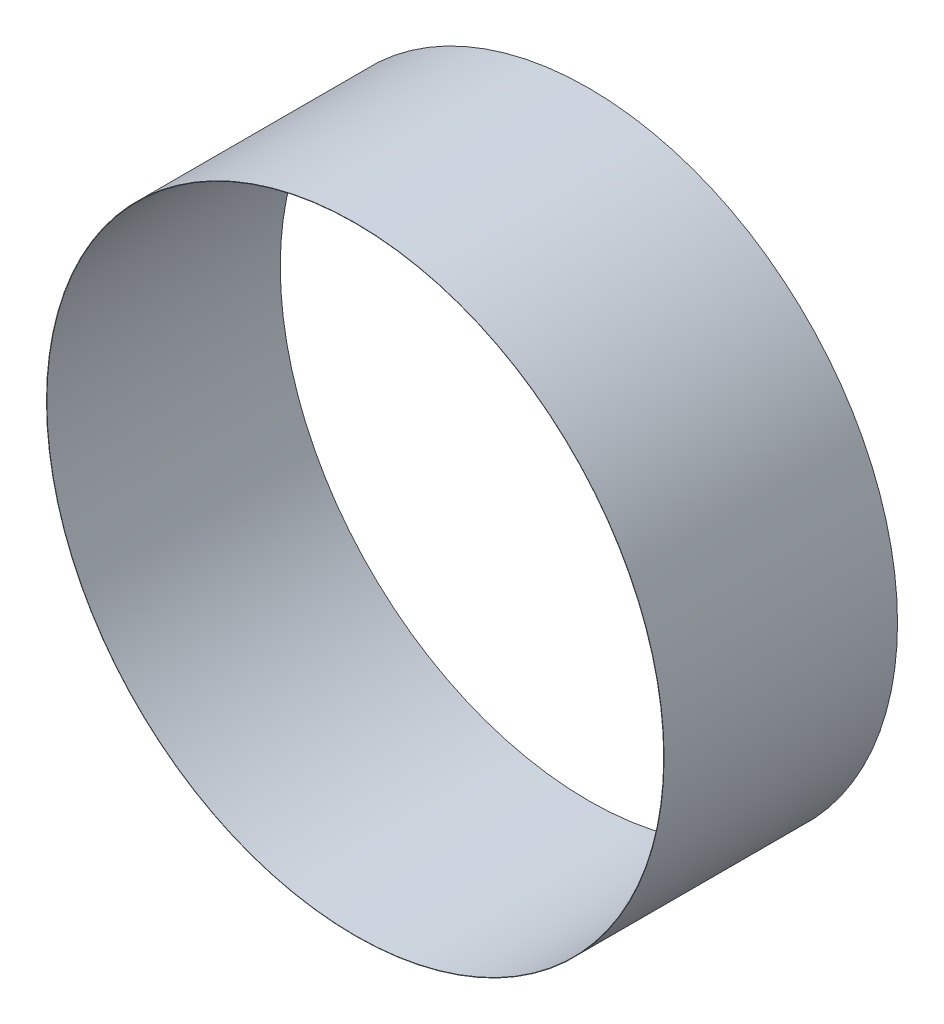
ISO-10303-21;
HEADER;
FILE_DESCRIPTION(('STEP AP214'),'2;1');
FILE_NAME('part.step','',(''),(''),'','','');
FILE_SCHEMA(('AUTOMOTIVE_DESIGN { 1 0 10303 214 1 1 1 1 }'));
ENDSEC;
DATA;
#1=APPLICATION_CONTEXT('core data for automotive mechanical design processes');
#2=APPLICATION_PROTOCOL_DEFINITION('international standard','automotive_design',2000,#1);
#3=PRODUCT_CONTEXT('',#1,'mechanical');
#4=PRODUCT('Part','Part','',(#3));
#5=PRODUCT_RELATED_PRODUCT_CATEGORY('part','',(#4));
#6=PRODUCT_DEFINITION_FORMATION('','',#4);
#7=PRODUCT_DEFINITION_CONTEXT('part definition',#1,'design');
#8=PRODUCT_DEFINITION('design','',#6,#7);
#9=PRODUCT_DEFINITION_SHAPE('','',#8);
#10=(LENGTH_UNIT() NAMED_UNIT(*) SI_UNIT(.MILLI.,.METRE.));
#11=(NAMED_UNIT(*) PLANE_ANGLE_UNIT() SI_UNIT($,.RADIAN.));
#12=(NAMED_UNIT(*) SI_UNIT($,.STERADIAN.) SOLID_ANGLE_UNIT());
#13=UNCERTAINTY_MEASURE_WITH_UNIT(LENGTH_MEASURE(1.E-05),#10,'distance_accuracy_value','');
#14=(GEOMETRIC_REPRESENTATION_CONTEXT(3) GLOBAL_UNCERTAINTY_ASSIGNED_CONTEXT((#13)) GLOBAL_UNIT_ASSIGNED_CONTEXT((#10,
#11,#12)) REPRESENTATION_CONTEXT('',''));
#15=CARTESIAN_POINT('',(0.,0.,0.));
#16=DIRECTION('',(0.,0.,1.));
#17=DIRECTION('',(1.,0.,0.));
#18=AXIS2_PLACEMENT_3D('',#15,#16,#17);
#19=CARTESIAN_POINT('',(0.,0.,70.));
#20=DIRECTION('',(0.,0.,1.));
#21=DIRECTION('',(1.,0.,0.));
#22=AXIS2_PLACEMENT_3D('',#19,#20,#21);
#23=PLANE('',#22);
#24=CARTESIAN_POINT('',(0.,0.,70.));
#25=DIRECTION('',(0.,0.,1.));
#26=DIRECTION('',(1.,0.,0.));
#27=AXIS2_PLACEMENT_3D('',#24,#25,#26);
#28=CIRCLE('',#27,92.6);
#29=CARTESIAN_POINT('',(92.6,0.,70.));
#30=VERTEX_POINT('',#29);
#31=EDGE_CURVE('E10',#30,#30,#28,.T.);
#32=ORIENTED_EDGE('',*,*,#31,.T.);
#33=EDGE_LOOP('',(#32));
#34=FACE_BOUND('',#33,.T.);
#35=CARTESIAN_POINT('',(0.,0.,70.));
#36=DIRECTION('',(0.,0.,1.));
#37=DIRECTION('',(1.,0.,0.));
#38=AXIS2_PLACEMENT_3D('',#35,#36,#37);
#39=CIRCLE('',#38,92.5);
#40=CARTESIAN_POINT('',(92.5,0.,70.));
#41=VERTEX_POINT('',#40);
#42=EDGE_CURVE('E44',#41,#41,#39,.T.);
#43=ORIENTED_EDGE('',*,*,#42,.F.);
#44=EDGE_LOOP('',(#43));
#45=FACE_BOUND('',#44,.T.);
#46=ADVANCED_FACE('F33',(#34,#45),#23,.T.);
#47=CARTESIAN_POINT('',(0.,0.,0.));
#48=DIRECTION('',(0.,0.,1.));
#49=DIRECTION('',(1.,0.,0.));
#50=AXIS2_PLACEMENT_3D('',#47,#48,#49);
#51=PLANE('',#50);
#52=CARTESIAN_POINT('',(0.,0.,0.));
#53=DIRECTION('',(0.,0.,1.));
#54=DIRECTION('',(1.,0.,0.));
#55=AXIS2_PLACEMENT_3D('',#52,#53,#54);
#56=CIRCLE('',#55,92.6);
#57=CARTESIAN_POINT('',(92.6,0.,0.));
#58=VERTEX_POINT('',#57);
#59=EDGE_CURVE('E37',#58,#58,#56,.T.);
#60=ORIENTED_EDGE('',*,*,#59,.F.);
#61=EDGE_LOOP('',(#60));
#62=FACE_BOUND('',#61,.T.);
#63=CARTESIAN_POINT('',(0.,0.,0.));
#64=DIRECTION('',(0.,0.,1.));
#65=DIRECTION('',(1.,0.,0.));
#66=AXIS2_PLACEMENT_3D('',#63,#64,#65);
#67=CIRCLE('',#66,92.5);
#68=CARTESIAN_POINT('',(92.5,0.,0.));
#69=VERTEX_POINT('',#68);
#70=EDGE_CURVE('E46',#69,#69,#67,.T.);
#71=ORIENTED_EDGE('',*,*,#70,.T.);
#72=EDGE_LOOP('',(#71));
#73=FACE_BOUND('',#72,.T.);
#74=ADVANCED_FACE('F56',(#62,#73),#51,.F.);
#75=CARTESIAN_POINT('',(0.,0.,70.));
#76=DIRECTION('',(0.,0.,-1.));
#77=DIRECTION('',(-1.,0.,0.));
#78=AXIS2_PLACEMENT_3D('',#75,#76,#77);
#79=CYLINDRICAL_SURFACE('',#78,92.6);
#80=ORIENTED_EDGE('',*,*,#31,.F.);
#81=EDGE_LOOP('',(#80));
#82=FACE_BOUND('',#81,.T.);
#83=ORIENTED_EDGE('',*,*,#59,.T.);
#84=EDGE_LOOP('',(#83));
#85=FACE_BOUND('',#84,.T.);
#86=ADVANCED_FACE('F35',(#82,#85),#79,.T.);
#87=CARTESIAN_POINT('',(0.,0.,70.));
#88=DIRECTION('',(0.,0.,-1.));
#89=DIRECTION('',(-1.,0.,0.));
#90=AXIS2_PLACEMENT_3D('',#87,#88,#89);
#91=CYLINDRICAL_SURFACE('',#90,92.5);
#92=ORIENTED_EDGE('',*,*,#42,.T.);
#93=EDGE_LOOP('',(#92));
#94=FACE_BOUND('',#93,.T.);
#95=ORIENTED_EDGE('',*,*,#70,.F.);
#96=EDGE_LOOP('',(#95));
#97=FACE_BOUND('',#96,.T.);
#98=ADVANCED_FACE('F52',(#94,#97),#91,.F.);
#99=CLOSED_SHELL('',(#46,#74,#86,#98));
#100=MANIFOLD_SOLID_BREP('B2',#99);
#101=ADVANCED_BREP_SHAPE_REPRESENTATION('',(#18,#100),#14);
#102=SHAPE_DEFINITION_REPRESENTATION(#9,#101);
ENDSEC;
END-ISO-10303-21;
